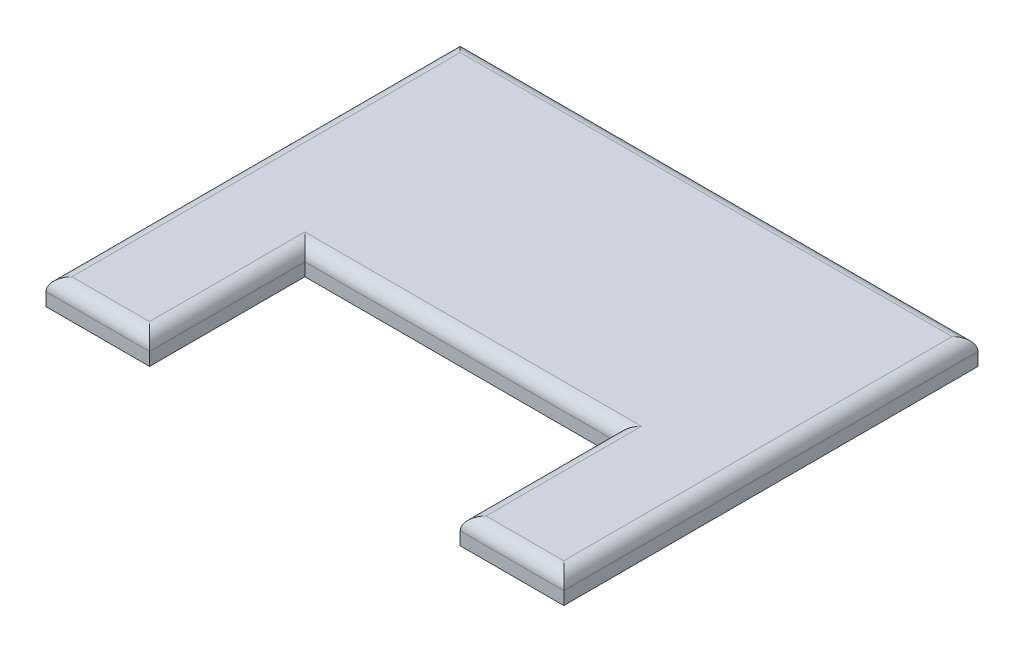
ISO-10303-21;
HEADER;
FILE_DESCRIPTION(('STEP AP214'),'2;1');
FILE_NAME('part.step','',(''),(''),'','','');
FILE_SCHEMA(('AUTOMOTIVE_DESIGN { 1 0 10303 214 1 1 1 1 }'));
ENDSEC;
DATA;
#1=APPLICATION_CONTEXT('core data for automotive mechanical design processes');
#2=APPLICATION_PROTOCOL_DEFINITION('international standard','automotive_design',2000,#1);
#3=PRODUCT_CONTEXT('',#1,'mechanical');
#4=PRODUCT('Part','Part','',(#3));
#5=PRODUCT_RELATED_PRODUCT_CATEGORY('part','',(#4));
#6=PRODUCT_DEFINITION_FORMATION('','',#4);
#7=PRODUCT_DEFINITION_CONTEXT('part definition',#1,'design');
#8=PRODUCT_DEFINITION('design','',#6,#7);
#9=PRODUCT_DEFINITION_SHAPE('','',#8);
#10=(LENGTH_UNIT() NAMED_UNIT(*) SI_UNIT(.MILLI.,.METRE.));
#11=(NAMED_UNIT(*) PLANE_ANGLE_UNIT() SI_UNIT($,.RADIAN.));
#12=(NAMED_UNIT(*) SI_UNIT($,.STERADIAN.) SOLID_ANGLE_UNIT());
#13=UNCERTAINTY_MEASURE_WITH_UNIT(LENGTH_MEASURE(1.E-05),#10,'distance_accuracy_value','');
#14=(GEOMETRIC_REPRESENTATION_CONTEXT(3) GLOBAL_UNCERTAINTY_ASSIGNED_CONTEXT((#13)) GLOBAL_UNIT_ASSIGNED_CONTEXT((#10,
#11,#12)) REPRESENTATION_CONTEXT('',''));
#15=CARTESIAN_POINT('',(0.,0.,0.));
#16=DIRECTION('',(0.,0.,1.));
#17=DIRECTION('',(1.,0.,0.));
#18=AXIS2_PLACEMENT_3D('',#15,#16,#17);
#19=CARTESIAN_POINT('',(60.,10.,80.));
#20=DIRECTION('',(0.,0.,-1.));
#21=DIRECTION('',(-1.,0.,0.));
#22=AXIS2_PLACEMENT_3D('',#19,#20,#21);
#23=PLANE('',#22);
#24=DIRECTION('',(0.,-1.,0.));
#25=VECTOR('',#24,1.);
#26=CARTESIAN_POINT('',(100.,10.,80.));
#27=LINE('',#26,#25);
#28=CARTESIAN_POINT('',(100.,5.,80.));
#29=VERTEX_POINT('',#28);
#30=CARTESIAN_POINT('',(100.,0.,80.));
#31=VERTEX_POINT('',#30);
#32=EDGE_CURVE('E121',#29,#31,#27,.T.);
#33=ORIENTED_EDGE('',*,*,#32,.F.);
#34=DIRECTION('',(1.,0.,0.));
#35=VECTOR('',#34,1.);
#36=CARTESIAN_POINT('',(60.,5.,80.));
#37=LINE('',#36,#35);
#38=CARTESIAN_POINT('',(60.,5.,80.));
#39=VERTEX_POINT('',#38);
#40=EDGE_CURVE('E11',#29,#39,#37,.F.);
#41=ORIENTED_EDGE('',*,*,#40,.T.);
#42=DIRECTION('',(0.,-1.,0.));
#43=VECTOR('',#42,1.);
#44=CARTESIAN_POINT('',(60.,10.,80.));
#45=LINE('',#44,#43);
#46=CARTESIAN_POINT('',(60.,0.,80.));
#47=VERTEX_POINT('',#46);
#48=EDGE_CURVE('E142',#39,#47,#45,.T.);
#49=ORIENTED_EDGE('',*,*,#48,.T.);
#50=DIRECTION('',(1.,0.,0.));
#51=VECTOR('',#50,1.);
#52=CARTESIAN_POINT('',(60.,0.,80.));
#53=LINE('',#52,#51);
#54=EDGE_CURVE('E136',#47,#31,#53,.T.);
#55=ORIENTED_EDGE('',*,*,#54,.T.);
#56=EDGE_LOOP('',(#33,#41,#49,#55));
#57=FACE_BOUND('',#56,.T.);
#58=ADVANCED_FACE('F33',(#57),#23,.F.);
#59=CARTESIAN_POINT('',(100.,10.,-80.));
#60=DIRECTION('',(-1.,0.,0.));
#61=DIRECTION('',(0.,0.,1.));
#62=AXIS2_PLACEMENT_3D('',#59,#60,#61);
#63=PLANE('',#62);
#64=DIRECTION('',(0.,-1.,0.));
#65=VECTOR('',#64,1.);
#66=CARTESIAN_POINT('',(100.,10.,-80.));
#67=LINE('',#66,#65);
#68=CARTESIAN_POINT('',(100.,5.,-80.));
#69=VERTEX_POINT('',#68);
#70=CARTESIAN_POINT('',(100.,0.,-80.));
#71=VERTEX_POINT('',#70);
#72=EDGE_CURVE('E130',#69,#71,#67,.T.);
#73=ORIENTED_EDGE('',*,*,#72,.F.);
#74=DIRECTION('',(0.,0.,-1.));
#75=VECTOR('',#74,1.);
#76=CARTESIAN_POINT('',(100.,5.,-80.));
#77=LINE('',#76,#75);
#78=EDGE_CURVE('E42',#69,#29,#77,.F.);
#79=ORIENTED_EDGE('',*,*,#78,.T.);
#80=ORIENTED_EDGE('',*,*,#32,.T.);
#81=DIRECTION('',(0.,0.,-1.));
#82=VECTOR('',#81,1.);
#83=CARTESIAN_POINT('',(100.,0.,-80.));
#84=LINE('',#83,#82);
#85=EDGE_CURVE('E124',#31,#71,#84,.T.);
#86=ORIENTED_EDGE('',*,*,#85,.T.);
#87=EDGE_LOOP('',(#73,#79,#80,#86));
#88=FACE_BOUND('',#87,.T.);
#89=ADVANCED_FACE('F123',(#88),#63,.F.);
#90=CARTESIAN_POINT('',(-100.,10.,-80.));
#91=DIRECTION('',(0.,0.,1.));
#92=DIRECTION('',(1.,0.,0.));
#93=AXIS2_PLACEMENT_3D('',#90,#91,#92);
#94=PLANE('',#93);
#95=DIRECTION('',(0.,-1.,0.));
#96=VECTOR('',#95,1.);
#97=CARTESIAN_POINT('',(-100.,10.,-80.));
#98=LINE('',#97,#96);
#99=CARTESIAN_POINT('',(-100.,5.,-80.));
#100=VERTEX_POINT('',#99);
#101=CARTESIAN_POINT('',(-100.,0.,-80.));
#102=VERTEX_POINT('',#101);
#103=EDGE_CURVE('E172',#100,#102,#98,.T.);
#104=ORIENTED_EDGE('',*,*,#103,.F.);
#105=DIRECTION('',(-1.,0.,0.));
#106=VECTOR('',#105,1.);
#107=CARTESIAN_POINT('',(-100.,5.,-80.));
#108=LINE('',#107,#106);
#109=EDGE_CURVE('E57',#100,#69,#108,.F.);
#110=ORIENTED_EDGE('',*,*,#109,.T.);
#111=ORIENTED_EDGE('',*,*,#72,.T.);
#112=DIRECTION('',(-1.,0.,0.));
#113=VECTOR('',#112,1.);
#114=CARTESIAN_POINT('',(-100.,0.,-80.));
#115=LINE('',#114,#113);
#116=EDGE_CURVE('E139',#71,#102,#115,.T.);
#117=ORIENTED_EDGE('',*,*,#116,.T.);
#118=EDGE_LOOP('',(#104,#110,#111,#117));
#119=FACE_BOUND('',#118,.T.);
#120=ADVANCED_FACE('F275',(#119),#94,.F.);
#121=CARTESIAN_POINT('',(-100.,10.,-80.));
#122=DIRECTION('',(1.,0.,0.));
#123=DIRECTION('',(0.,0.,-1.));
#124=AXIS2_PLACEMENT_3D('',#121,#122,#123);
#125=PLANE('',#124);
#126=DIRECTION('',(0.,-1.,0.));
#127=VECTOR('',#126,1.);
#128=CARTESIAN_POINT('',(-100.,10.,80.));
#129=LINE('',#128,#127);
#130=CARTESIAN_POINT('',(-100.,5.,80.));
#131=VERTEX_POINT('',#130);
#132=CARTESIAN_POINT('',(-100.,0.,80.));
#133=VERTEX_POINT('',#132);
#134=EDGE_CURVE('E170',#131,#133,#129,.T.);
#135=ORIENTED_EDGE('',*,*,#134,.F.);
#136=DIRECTION('',(0.,0.,1.));
#137=VECTOR('',#136,1.);
#138=CARTESIAN_POINT('',(-100.,5.,-80.));
#139=LINE('',#138,#137);
#140=EDGE_CURVE('E200',#131,#100,#139,.F.);
#141=ORIENTED_EDGE('',*,*,#140,.T.);
#142=ORIENTED_EDGE('',*,*,#103,.T.);
#143=DIRECTION('',(0.,0.,1.));
#144=VECTOR('',#143,1.);
#145=CARTESIAN_POINT('',(-100.,0.,-80.));
#146=LINE('',#145,#144);
#147=EDGE_CURVE('E149',#102,#133,#146,.T.);
#148=ORIENTED_EDGE('',*,*,#147,.T.);
#149=EDGE_LOOP('',(#135,#141,#142,#148));
#150=FACE_BOUND('',#149,.T.);
#151=ADVANCED_FACE('F273',(#150),#125,.F.);
#152=CARTESIAN_POINT('',(-100.,10.,80.));
#153=DIRECTION('',(0.,0.,-1.));
#154=DIRECTION('',(-1.,0.,0.));
#155=AXIS2_PLACEMENT_3D('',#152,#153,#154);
#156=PLANE('',#155);
#157=DIRECTION('',(0.,-1.,0.));
#158=VECTOR('',#157,1.);
#159=CARTESIAN_POINT('',(-60.,10.,80.));
#160=LINE('',#159,#158);
#161=CARTESIAN_POINT('',(-60.,5.,80.));
#162=VERTEX_POINT('',#161);
#163=CARTESIAN_POINT('',(-60.,0.,80.));
#164=VERTEX_POINT('',#163);
#165=EDGE_CURVE('E168',#162,#164,#160,.T.);
#166=ORIENTED_EDGE('',*,*,#165,.F.);
#167=DIRECTION('',(1.,0.,0.));
#168=VECTOR('',#167,1.);
#169=CARTESIAN_POINT('',(-100.,5.,80.));
#170=LINE('',#169,#168);
#171=EDGE_CURVE('E198',#162,#131,#170,.F.);
#172=ORIENTED_EDGE('',*,*,#171,.T.);
#173=ORIENTED_EDGE('',*,*,#134,.T.);
#174=DIRECTION('',(1.,0.,0.));
#175=VECTOR('',#174,1.);
#176=CARTESIAN_POINT('',(-100.,0.,80.));
#177=LINE('',#176,#175);
#178=EDGE_CURVE('E152',#133,#164,#177,.T.);
#179=ORIENTED_EDGE('',*,*,#178,.T.);
#180=EDGE_LOOP('',(#166,#172,#173,#179));
#181=FACE_BOUND('',#180,.T.);
#182=ADVANCED_FACE('F271',(#181),#156,.F.);
#183=CARTESIAN_POINT('',(-60.,10.,80.));
#184=DIRECTION('',(-1.,0.,0.));
#185=DIRECTION('',(0.,0.,1.));
#186=AXIS2_PLACEMENT_3D('',#183,#184,#185);
#187=PLANE('',#186);
#188=DIRECTION('',(0.,-1.,0.));
#189=VECTOR('',#188,1.);
#190=CARTESIAN_POINT('',(-60.,10.,20.));
#191=LINE('',#190,#189);
#192=CARTESIAN_POINT('',(-60.,5.,20.));
#193=VERTEX_POINT('',#192);
#194=CARTESIAN_POINT('',(-60.,0.,20.));
#195=VERTEX_POINT('',#194);
#196=EDGE_CURVE('E166',#193,#195,#191,.T.);
#197=ORIENTED_EDGE('',*,*,#196,.F.);
#198=DIRECTION('',(0.,0.,-1.));
#199=VECTOR('',#198,1.);
#200=CARTESIAN_POINT('',(-60.,5.,80.));
#201=LINE('',#200,#199);
#202=EDGE_CURVE('E196',#193,#162,#201,.F.);
#203=ORIENTED_EDGE('',*,*,#202,.T.);
#204=ORIENTED_EDGE('',*,*,#165,.T.);
#205=DIRECTION('',(0.,0.,-1.));
#206=VECTOR('',#205,1.);
#207=CARTESIAN_POINT('',(-60.,0.,80.));
#208=LINE('',#207,#206);
#209=EDGE_CURVE('E155',#164,#195,#208,.T.);
#210=ORIENTED_EDGE('',*,*,#209,.T.);
#211=EDGE_LOOP('',(#197,#203,#204,#210));
#212=FACE_BOUND('',#211,.T.);
#213=ADVANCED_FACE('F259',(#212),#187,.F.);
#214=CARTESIAN_POINT('',(-60.,10.,20.));
#215=DIRECTION('',(0.,0.,-1.));
#216=DIRECTION('',(-1.,0.,0.));
#217=AXIS2_PLACEMENT_3D('',#214,#215,#216);
#218=PLANE('',#217);
#219=DIRECTION('',(0.,-1.,0.));
#220=VECTOR('',#219,1.);
#221=CARTESIAN_POINT('',(60.,10.,20.));
#222=LINE('',#221,#220);
#223=CARTESIAN_POINT('',(60.,5.,20.));
#224=VERTEX_POINT('',#223);
#225=CARTESIAN_POINT('',(60.,0.,20.));
#226=VERTEX_POINT('',#225);
#227=EDGE_CURVE('E164',#224,#226,#222,.T.);
#228=ORIENTED_EDGE('',*,*,#227,.F.);
#229=DIRECTION('',(1.,0.,0.));
#230=VECTOR('',#229,1.);
#231=CARTESIAN_POINT('',(-60.,5.,20.));
#232=LINE('',#231,#230);
#233=EDGE_CURVE('E194',#224,#193,#232,.F.);
#234=ORIENTED_EDGE('',*,*,#233,.T.);
#235=ORIENTED_EDGE('',*,*,#196,.T.);
#236=DIRECTION('',(1.,0.,0.));
#237=VECTOR('',#236,1.);
#238=CARTESIAN_POINT('',(-60.,0.,20.));
#239=LINE('',#238,#237);
#240=EDGE_CURVE('E158',#195,#226,#239,.T.);
#241=ORIENTED_EDGE('',*,*,#240,.T.);
#242=EDGE_LOOP('',(#228,#234,#235,#241));
#243=FACE_BOUND('',#242,.T.);
#244=ADVANCED_FACE('F256',(#243),#218,.F.);
#245=CARTESIAN_POINT('',(60.,10.,20.));
#246=DIRECTION('',(1.,0.,0.));
#247=DIRECTION('',(0.,0.,-1.));
#248=AXIS2_PLACEMENT_3D('',#245,#246,#247);
#249=PLANE('',#248);
#250=ORIENTED_EDGE('',*,*,#48,.F.);
#251=DIRECTION('',(0.,0.,1.));
#252=VECTOR('',#251,1.);
#253=CARTESIAN_POINT('',(60.,5.,20.));
#254=LINE('',#253,#252);
#255=EDGE_CURVE('E191',#39,#224,#254,.F.);
#256=ORIENTED_EDGE('',*,*,#255,.T.);
#257=ORIENTED_EDGE('',*,*,#227,.T.);
#258=DIRECTION('',(0.,0.,1.));
#259=VECTOR('',#258,1.);
#260=CARTESIAN_POINT('',(60.,0.,20.));
#261=LINE('',#260,#259);
#262=EDGE_CURVE('E161',#226,#47,#261,.T.);
#263=ORIENTED_EDGE('',*,*,#262,.T.);
#264=EDGE_LOOP('',(#250,#256,#257,#263));
#265=FACE_BOUND('',#264,.T.);
#266=ADVANCED_FACE('F243',(#265),#249,.F.);
#267=CARTESIAN_POINT('',(0.,10.,0.));
#268=DIRECTION('',(0.,-1.,0.));
#269=DIRECTION('',(0.,0.,-1.));
#270=AXIS2_PLACEMENT_3D('',#267,#268,#269);
#271=PLANE('',#270);
#272=DIRECTION('',(1.,0.,0.));
#273=VECTOR('',#272,1.);
#274=CARTESIAN_POINT('',(0.,10.,15.));
#275=LINE('',#274,#273);
#276=CARTESIAN_POINT('',(-65.,10.,15.));
#277=VERTEX_POINT('',#276);
#278=CARTESIAN_POINT('',(65.,10.,15.));
#279=VERTEX_POINT('',#278);
#280=EDGE_CURVE('E186',#277,#279,#275,.T.);
#281=ORIENTED_EDGE('',*,*,#280,.T.);
#282=DIRECTION('',(0.,0.,1.));
#283=VECTOR('',#282,1.);
#284=CARTESIAN_POINT('',(65.,10.,0.));
#285=LINE('',#284,#283);
#286=CARTESIAN_POINT('',(65.,10.,75.));
#287=VERTEX_POINT('',#286);
#288=EDGE_CURVE('E188',#279,#287,#285,.T.);
#289=ORIENTED_EDGE('',*,*,#288,.T.);
#290=DIRECTION('',(1.,0.,0.));
#291=VECTOR('',#290,1.);
#292=CARTESIAN_POINT('',(0.,10.,75.));
#293=LINE('',#292,#291);
#294=CARTESIAN_POINT('',(95.,10.,75.));
#295=VERTEX_POINT('',#294);
#296=EDGE_CURVE('E129',#287,#295,#293,.T.);
#297=ORIENTED_EDGE('',*,*,#296,.T.);
#298=DIRECTION('',(0.,0.,-1.));
#299=VECTOR('',#298,1.);
#300=CARTESIAN_POINT('',(95.,10.,0.));
#301=LINE('',#300,#299);
#302=CARTESIAN_POINT('',(95.,10.,-75.));
#303=VERTEX_POINT('',#302);
#304=EDGE_CURVE('E176',#295,#303,#301,.T.);
#305=ORIENTED_EDGE('',*,*,#304,.T.);
#306=DIRECTION('',(-1.,0.,0.));
#307=VECTOR('',#306,1.);
#308=CARTESIAN_POINT('',(0.,10.,-75.));
#309=LINE('',#308,#307);
#310=CARTESIAN_POINT('',(-95.,10.,-75.));
#311=VERTEX_POINT('',#310);
#312=EDGE_CURVE('E178',#303,#311,#309,.T.);
#313=ORIENTED_EDGE('',*,*,#312,.T.);
#314=DIRECTION('',(0.,0.,1.));
#315=VECTOR('',#314,1.);
#316=CARTESIAN_POINT('',(-95.,10.,0.));
#317=LINE('',#316,#315);
#318=CARTESIAN_POINT('',(-95.,10.,75.));
#319=VERTEX_POINT('',#318);
#320=EDGE_CURVE('E180',#311,#319,#317,.T.);
#321=ORIENTED_EDGE('',*,*,#320,.T.);
#322=DIRECTION('',(1.,0.,0.));
#323=VECTOR('',#322,1.);
#324=CARTESIAN_POINT('',(0.,10.,75.));
#325=LINE('',#324,#323);
#326=CARTESIAN_POINT('',(-65.,10.,75.));
#327=VERTEX_POINT('',#326);
#328=EDGE_CURVE('E182',#319,#327,#325,.T.);
#329=ORIENTED_EDGE('',*,*,#328,.T.);
#330=DIRECTION('',(0.,0.,-1.));
#331=VECTOR('',#330,1.);
#332=CARTESIAN_POINT('',(-65.,10.,0.));
#333=LINE('',#332,#331);
#334=EDGE_CURVE('E184',#327,#277,#333,.T.);
#335=ORIENTED_EDGE('',*,*,#334,.T.);
#336=EDGE_LOOP('',(#281,#289,#297,#305,#313,#321,#329,#335));
#337=FACE_BOUND('',#336,.T.);
#338=ADVANCED_FACE('F231',(#337),#271,.F.);
#339=CARTESIAN_POINT('',(0.,0.,0.));
#340=DIRECTION('',(0.,-1.,0.));
#341=DIRECTION('',(0.,0.,-1.));
#342=AXIS2_PLACEMENT_3D('',#339,#340,#341);
#343=PLANE('',#342);
#344=ORIENTED_EDGE('',*,*,#54,.F.);
#345=ORIENTED_EDGE('',*,*,#262,.F.);
#346=ORIENTED_EDGE('',*,*,#240,.F.);
#347=ORIENTED_EDGE('',*,*,#209,.F.);
#348=ORIENTED_EDGE('',*,*,#178,.F.);
#349=ORIENTED_EDGE('',*,*,#147,.F.);
#350=ORIENTED_EDGE('',*,*,#116,.F.);
#351=ORIENTED_EDGE('',*,*,#85,.F.);
#352=EDGE_LOOP('',(#344,#345,#346,#347,#348,#349,#350,#351));
#353=FACE_BOUND('',#352,.T.);
#354=ADVANCED_FACE('F134',(#353),#343,.T.);
#355=CARTESIAN_POINT('',(-95.,5.,0.));
#356=DIRECTION('',(0.,0.,1.));
#357=DIRECTION('',(1.,0.,0.));
#358=AXIS2_PLACEMENT_3D('',#355,#356,#357);
#359=CYLINDRICAL_SURFACE('',#358,5.);
#360=CARTESIAN_POINT('',(-95.,5.,-75.));
#361=DIRECTION('',(-0.707106781186547,0.,0.707106781186548));
#362=DIRECTION('',(-0.707106781186548,0.,-0.707106781186547));
#363=AXIS2_PLACEMENT_3D('',#360,#361,#362);
#364=ELLIPSE('',#363,7.07106781186548,5.);
#365=EDGE_CURVE('E146',#100,#311,#364,.F.);
#366=ORIENTED_EDGE('',*,*,#365,.F.);
#367=ORIENTED_EDGE('',*,*,#140,.F.);
#368=CARTESIAN_POINT('',(-95.,5.,75.));
#369=DIRECTION('',(0.707106781186548,0.,0.707106781186547));
#370=DIRECTION('',(-0.707106781186547,0.,0.707106781186548));
#371=AXIS2_PLACEMENT_3D('',#368,#369,#370);
#372=ELLIPSE('',#371,7.07106781186547,5.);
#373=EDGE_CURVE('E37',#319,#131,#372,.T.);
#374=ORIENTED_EDGE('',*,*,#373,.F.);
#375=ORIENTED_EDGE('',*,*,#320,.F.);
#376=EDGE_LOOP('',(#366,#367,#374,#375));
#377=FACE_BOUND('',#376,.T.);
#378=ADVANCED_FACE('F35',(#377),#359,.T.);
#379=CARTESIAN_POINT('',(0.,5.,75.));
#380=DIRECTION('',(1.,0.,0.));
#381=DIRECTION('',(0.,0.,-1.));
#382=AXIS2_PLACEMENT_3D('',#379,#380,#381);
#383=CYLINDRICAL_SURFACE('',#382,5.);
#384=ORIENTED_EDGE('',*,*,#373,.T.);
#385=ORIENTED_EDGE('',*,*,#171,.F.);
#386=CARTESIAN_POINT('',(-65.,5.,75.));
#387=DIRECTION('',(0.707106781186547,0.,-0.707106781186547));
#388=DIRECTION('',(0.707106781186547,0.,0.707106781186547));
#389=AXIS2_PLACEMENT_3D('',#386,#387,#388);
#390=ELLIPSE('',#389,7.07106781186547,5.);
#391=EDGE_CURVE('E217',#327,#162,#390,.T.);
#392=ORIENTED_EDGE('',*,*,#391,.F.);
#393=ORIENTED_EDGE('',*,*,#328,.F.);
#394=EDGE_LOOP('',(#384,#385,#392,#393));
#395=FACE_BOUND('',#394,.T.);
#396=ADVANCED_FACE('F268',(#395),#383,.T.);
#397=CARTESIAN_POINT('',(0.,5.,-75.));
#398=DIRECTION('',(-1.,0.,0.));
#399=DIRECTION('',(0.,0.,1.));
#400=AXIS2_PLACEMENT_3D('',#397,#398,#399);
#401=CYLINDRICAL_SURFACE('',#400,5.);
#402=ORIENTED_EDGE('',*,*,#365,.T.);
#403=ORIENTED_EDGE('',*,*,#312,.F.);
#404=CARTESIAN_POINT('',(95.,5.,-75.));
#405=DIRECTION('',(-0.707106781186548,0.,-0.707106781186547));
#406=DIRECTION('',(0.707106781186547,0.,-0.707106781186548));
#407=AXIS2_PLACEMENT_3D('',#404,#405,#406);
#408=ELLIPSE('',#407,7.07106781186547,5.);
#409=EDGE_CURVE('E214',#69,#303,#408,.F.);
#410=ORIENTED_EDGE('',*,*,#409,.F.);
#411=ORIENTED_EDGE('',*,*,#109,.F.);
#412=EDGE_LOOP('',(#402,#403,#410,#411));
#413=FACE_BOUND('',#412,.T.);
#414=ADVANCED_FACE('F223',(#413),#401,.T.);
#415=CARTESIAN_POINT('',(-65.,5.,0.));
#416=DIRECTION('',(0.,0.,-1.));
#417=DIRECTION('',(-1.,0.,0.));
#418=AXIS2_PLACEMENT_3D('',#415,#416,#417);
#419=CYLINDRICAL_SURFACE('',#418,5.);
#420=ORIENTED_EDGE('',*,*,#391,.T.);
#421=ORIENTED_EDGE('',*,*,#202,.F.);
#422=CARTESIAN_POINT('',(-65.,5.,15.));
#423=DIRECTION('',(0.707106781186547,0.,-0.707106781186547));
#424=DIRECTION('',(0.707106781186547,0.,0.707106781186547));
#425=AXIS2_PLACEMENT_3D('',#422,#423,#424);
#426=ELLIPSE('',#425,7.07106781186547,5.);
#427=EDGE_CURVE('E211',#277,#193,#426,.T.);
#428=ORIENTED_EDGE('',*,*,#427,.F.);
#429=ORIENTED_EDGE('',*,*,#334,.F.);
#430=EDGE_LOOP('',(#420,#421,#428,#429));
#431=FACE_BOUND('',#430,.T.);
#432=ADVANCED_FACE('F264',(#431),#419,.T.);
#433=CARTESIAN_POINT('',(95.,5.,0.));
#434=DIRECTION('',(0.,0.,-1.));
#435=DIRECTION('',(-1.,0.,0.));
#436=AXIS2_PLACEMENT_3D('',#433,#434,#435);
#437=CYLINDRICAL_SURFACE('',#436,5.);
#438=ORIENTED_EDGE('',*,*,#409,.T.);
#439=ORIENTED_EDGE('',*,*,#304,.F.);
#440=CARTESIAN_POINT('',(95.,5.,75.));
#441=DIRECTION('',(0.707106781186547,0.,-0.707106781186548));
#442=DIRECTION('',(0.707106781186548,0.,0.707106781186547));
#443=AXIS2_PLACEMENT_3D('',#440,#441,#442);
#444=ELLIPSE('',#443,7.07106781186548,5.);
#445=EDGE_CURVE('E208',#29,#295,#444,.F.);
#446=ORIENTED_EDGE('',*,*,#445,.F.);
#447=ORIENTED_EDGE('',*,*,#78,.F.);
#448=EDGE_LOOP('',(#438,#439,#446,#447));
#449=FACE_BOUND('',#448,.T.);
#450=ADVANCED_FACE('F236',(#449),#437,.T.);
#451=CARTESIAN_POINT('',(0.,5.,15.));
#452=DIRECTION('',(1.,0.,0.));
#453=DIRECTION('',(0.,0.,-1.));
#454=AXIS2_PLACEMENT_3D('',#451,#452,#453);
#455=CYLINDRICAL_SURFACE('',#454,5.);
#456=ORIENTED_EDGE('',*,*,#427,.T.);
#457=ORIENTED_EDGE('',*,*,#233,.F.);
#458=CARTESIAN_POINT('',(65.,5.,15.));
#459=DIRECTION('',(0.707106781186547,0.,0.707106781186547));
#460=DIRECTION('',(-0.707106781186547,0.,0.707106781186547));
#461=AXIS2_PLACEMENT_3D('',#458,#459,#460);
#462=ELLIPSE('',#461,7.07106781186547,5.);
#463=EDGE_CURVE('E206',#279,#224,#462,.T.);
#464=ORIENTED_EDGE('',*,*,#463,.F.);
#465=ORIENTED_EDGE('',*,*,#280,.F.);
#466=EDGE_LOOP('',(#456,#457,#464,#465));
#467=FACE_BOUND('',#466,.T.);
#468=ADVANCED_FACE('F252',(#467),#455,.T.);
#469=CARTESIAN_POINT('',(0.,5.,75.));
#470=DIRECTION('',(1.,0.,0.));
#471=DIRECTION('',(0.,0.,-1.));
#472=AXIS2_PLACEMENT_3D('',#469,#470,#471);
#473=CYLINDRICAL_SURFACE('',#472,5.);
#474=ORIENTED_EDGE('',*,*,#445,.T.);
#475=ORIENTED_EDGE('',*,*,#296,.F.);
#476=CARTESIAN_POINT('',(65.,5.,75.));
#477=DIRECTION('',(0.707106781186547,0.,0.707106781186547));
#478=DIRECTION('',(0.707106781186547,0.,-0.707106781186547));
#479=AXIS2_PLACEMENT_3D('',#476,#477,#478);
#480=ELLIPSE('',#479,7.07106781186547,5.);
#481=EDGE_CURVE('E204',#39,#287,#480,.F.);
#482=ORIENTED_EDGE('',*,*,#481,.F.);
#483=ORIENTED_EDGE('',*,*,#40,.F.);
#484=EDGE_LOOP('',(#474,#475,#482,#483));
#485=FACE_BOUND('',#484,.T.);
#486=ADVANCED_FACE('F239',(#485),#473,.T.);
#487=CARTESIAN_POINT('',(65.,5.,0.));
#488=DIRECTION('',(0.,0.,1.));
#489=DIRECTION('',(1.,0.,0.));
#490=AXIS2_PLACEMENT_3D('',#487,#488,#489);
#491=CYLINDRICAL_SURFACE('',#490,5.);
#492=ORIENTED_EDGE('',*,*,#463,.T.);
#493=ORIENTED_EDGE('',*,*,#255,.F.);
#494=ORIENTED_EDGE('',*,*,#481,.T.);
#495=ORIENTED_EDGE('',*,*,#288,.F.);
#496=EDGE_LOOP('',(#492,#493,#494,#495));
#497=FACE_BOUND('',#496,.T.);
#498=ADVANCED_FACE('F246',(#497),#491,.T.);
#499=CLOSED_SHELL('',(#58,#89,#120,#151,#182,#213,#244,#266,#338,#354,#378,#396,#414,#432,#450,
#468,#486,#498));
#500=MANIFOLD_SOLID_BREP('B2',#499);
#501=ADVANCED_BREP_SHAPE_REPRESENTATION('',(#18,#500),#14);
#502=SHAPE_DEFINITION_REPRESENTATION(#9,#501);
ENDSEC;
END-ISO-10303-21;
